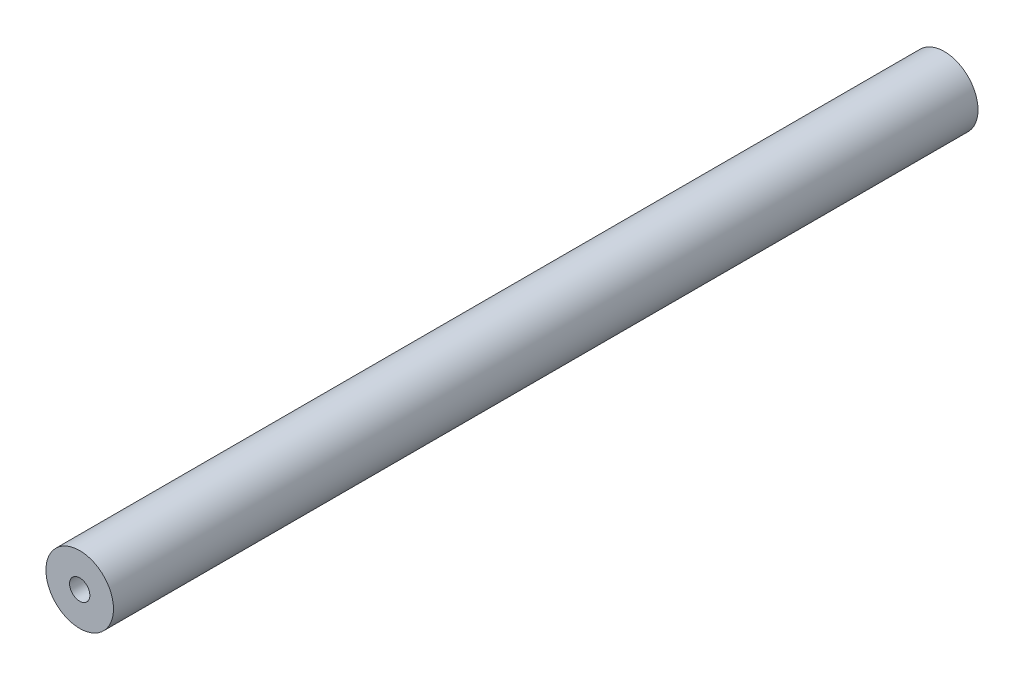
ISO-10303-21;
HEADER;
FILE_DESCRIPTION(('STEP AP214'),'2;1');
FILE_NAME('part.step','',(''),(''),'','','');
FILE_SCHEMA(('AUTOMOTIVE_DESIGN { 1 0 10303 214 1 1 1 1 }'));
ENDSEC;
DATA;
#1=APPLICATION_CONTEXT('core data for automotive mechanical design processes');
#2=APPLICATION_PROTOCOL_DEFINITION('international standard','automotive_design',2000,#1);
#3=PRODUCT_CONTEXT('',#1,'mechanical');
#4=PRODUCT('Part','Part','',(#3));
#5=PRODUCT_RELATED_PRODUCT_CATEGORY('part','',(#4));
#6=PRODUCT_DEFINITION_FORMATION('','',#4);
#7=PRODUCT_DEFINITION_CONTEXT('part definition',#1,'design');
#8=PRODUCT_DEFINITION('design','',#6,#7);
#9=PRODUCT_DEFINITION_SHAPE('','',#8);
#10=(LENGTH_UNIT() NAMED_UNIT(*) SI_UNIT(.MILLI.,.METRE.));
#11=(NAMED_UNIT(*) PLANE_ANGLE_UNIT() SI_UNIT($,.RADIAN.));
#12=(NAMED_UNIT(*) SI_UNIT($,.STERADIAN.) SOLID_ANGLE_UNIT());
#13=UNCERTAINTY_MEASURE_WITH_UNIT(LENGTH_MEASURE(1.E-05),#10,'distance_accuracy_value','');
#14=(GEOMETRIC_REPRESENTATION_CONTEXT(3) GLOBAL_UNCERTAINTY_ASSIGNED_CONTEXT((#13)) GLOBAL_UNIT_ASSIGNED_CONTEXT((#10,
#11,#12)) REPRESENTATION_CONTEXT('',''));
#15=CARTESIAN_POINT('',(0.,0.,0.));
#16=DIRECTION('',(0.,0.,1.));
#17=DIRECTION('',(1.,0.,0.));
#18=AXIS2_PLACEMENT_3D('',#15,#16,#17);
#19=CARTESIAN_POINT('',(0.,0.,812.8));
#20=DIRECTION('',(0.,0.,1.));
#21=DIRECTION('',(1.,0.,0.));
#22=AXIS2_PLACEMENT_3D('',#19,#20,#21);
#23=PLANE('',#22);
#24=CARTESIAN_POINT('',(0.,0.,812.8));
#25=DIRECTION('',(0.,0.,1.));
#26=DIRECTION('',(1.,0.,0.));
#27=AXIS2_PLACEMENT_3D('',#24,#25,#26);
#28=CIRCLE('',#27,31.75);
#29=CARTESIAN_POINT('',(31.75,0.,812.8));
#30=VERTEX_POINT('',#29);
#31=EDGE_CURVE('E10',#30,#30,#28,.T.);
#32=ORIENTED_EDGE('',*,*,#31,.T.);
#33=EDGE_LOOP('',(#32));
#34=FACE_BOUND('',#33,.T.);
#35=CARTESIAN_POINT('',(0.,0.,812.8));
#36=DIRECTION('',(0.,0.,1.));
#37=DIRECTION('',(1.,0.,0.));
#38=AXIS2_PLACEMENT_3D('',#35,#36,#37);
#39=CIRCLE('',#38,9.525);
#40=CARTESIAN_POINT('',(9.525,0.,812.8));
#41=VERTEX_POINT('',#40);
#42=EDGE_CURVE('E42',#41,#41,#39,.T.);
#43=ORIENTED_EDGE('',*,*,#42,.F.);
#44=EDGE_LOOP('',(#43));
#45=FACE_BOUND('',#44,.T.);
#46=ADVANCED_FACE('F31',(#34,#45),#23,.T.);
#47=CARTESIAN_POINT('',(0.,0.,0.));
#48=DIRECTION('',(0.,0.,1.));
#49=DIRECTION('',(1.,0.,0.));
#50=AXIS2_PLACEMENT_3D('',#47,#48,#49);
#51=PLANE('',#50);
#52=CARTESIAN_POINT('',(0.,0.,0.));
#53=DIRECTION('',(0.,0.,1.));
#54=DIRECTION('',(1.,0.,0.));
#55=AXIS2_PLACEMENT_3D('',#52,#53,#54);
#56=CIRCLE('',#55,31.75);
#57=CARTESIAN_POINT('',(31.75,0.,0.));
#58=VERTEX_POINT('',#57);
#59=EDGE_CURVE('E35',#58,#58,#56,.T.);
#60=ORIENTED_EDGE('',*,*,#59,.F.);
#61=EDGE_LOOP('',(#60));
#62=FACE_BOUND('',#61,.T.);
#63=CARTESIAN_POINT('',(0.,0.,0.));
#64=DIRECTION('',(0.,0.,1.));
#65=DIRECTION('',(1.,0.,0.));
#66=AXIS2_PLACEMENT_3D('',#63,#64,#65);
#67=CIRCLE('',#66,9.525);
#68=CARTESIAN_POINT('',(9.525,0.,0.));
#69=VERTEX_POINT('',#68);
#70=EDGE_CURVE('E44',#69,#69,#67,.T.);
#71=ORIENTED_EDGE('',*,*,#70,.T.);
#72=EDGE_LOOP('',(#71));
#73=FACE_BOUND('',#72,.T.);
#74=ADVANCED_FACE('F54',(#62,#73),#51,.F.);
#75=CARTESIAN_POINT('',(0.,0.,812.8));
#76=DIRECTION('',(0.,0.,-1.));
#77=DIRECTION('',(-1.,0.,0.));
#78=AXIS2_PLACEMENT_3D('',#75,#76,#77);
#79=CYLINDRICAL_SURFACE('',#78,31.75);
#80=ORIENTED_EDGE('',*,*,#31,.F.);
#81=EDGE_LOOP('',(#80));
#82=FACE_BOUND('',#81,.T.);
#83=ORIENTED_EDGE('',*,*,#59,.T.);
#84=EDGE_LOOP('',(#83));
#85=FACE_BOUND('',#84,.T.);
#86=ADVANCED_FACE('F33',(#82,#85),#79,.T.);
#87=CARTESIAN_POINT('',(0.,0.,812.8));
#88=DIRECTION('',(0.,0.,-1.));
#89=DIRECTION('',(-1.,0.,0.));
#90=AXIS2_PLACEMENT_3D('',#87,#88,#89);
#91=CYLINDRICAL_SURFACE('',#90,9.525);
#92=ORIENTED_EDGE('',*,*,#42,.T.);
#93=EDGE_LOOP('',(#92));
#94=FACE_BOUND('',#93,.T.);
#95=ORIENTED_EDGE('',*,*,#70,.F.);
#96=EDGE_LOOP('',(#95));
#97=FACE_BOUND('',#96,.T.);
#98=ADVANCED_FACE('F50',(#94,#97),#91,.F.);
#99=CLOSED_SHELL('',(#46,#74,#86,#98));
#100=MANIFOLD_SOLID_BREP('B2',#99);
#101=ADVANCED_BREP_SHAPE_REPRESENTATION('',(#18,#100),#14);
#102=SHAPE_DEFINITION_REPRESENTATION(#9,#101);
ENDSEC;
END-ISO-10303-21;
